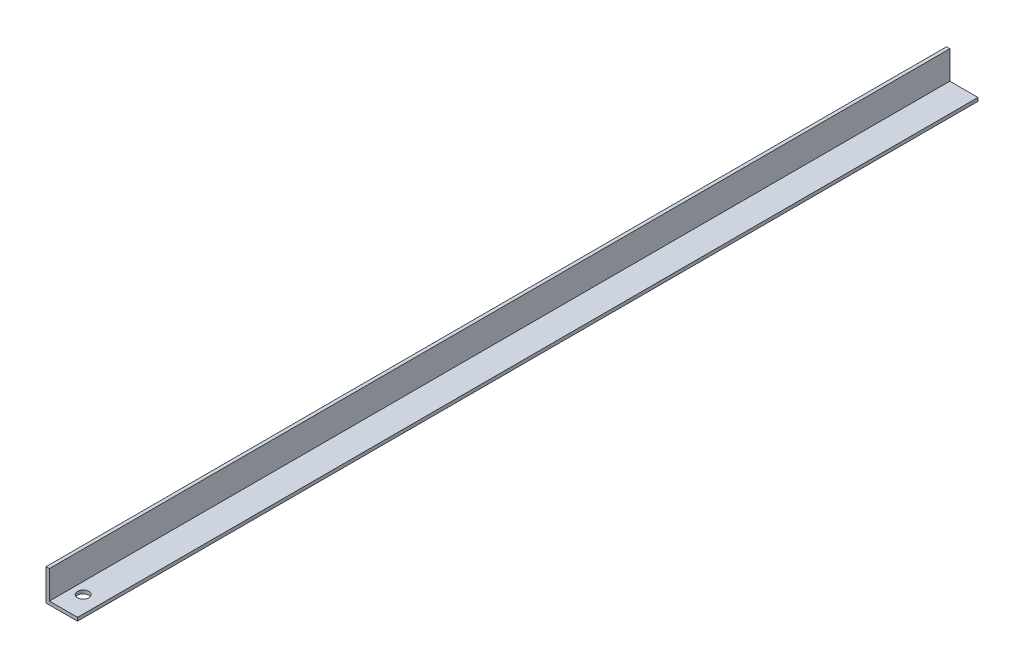
ISO-10303-21;
HEADER;
FILE_DESCRIPTION(('STEP AP214'),'2;1');
FILE_NAME('part.step','',(''),(''),'','','');
FILE_SCHEMA(('AUTOMOTIVE_DESIGN { 1 0 10303 214 1 1 1 1 }'));
ENDSEC;
DATA;
#1=APPLICATION_CONTEXT('core data for automotive mechanical design processes');
#2=APPLICATION_PROTOCOL_DEFINITION('international standard','automotive_design',2000,#1);
#3=PRODUCT_CONTEXT('',#1,'mechanical');
#4=PRODUCT('Part','Part','',(#3));
#5=PRODUCT_RELATED_PRODUCT_CATEGORY('part','',(#4));
#6=PRODUCT_DEFINITION_FORMATION('','',#4);
#7=PRODUCT_DEFINITION_CONTEXT('part definition',#1,'design');
#8=PRODUCT_DEFINITION('design','',#6,#7);
#9=PRODUCT_DEFINITION_SHAPE('','',#8);
#10=(LENGTH_UNIT() NAMED_UNIT(*) SI_UNIT(.MILLI.,.METRE.));
#11=(NAMED_UNIT(*) PLANE_ANGLE_UNIT() SI_UNIT($,.RADIAN.));
#12=(NAMED_UNIT(*) SI_UNIT($,.STERADIAN.) SOLID_ANGLE_UNIT());
#13=UNCERTAINTY_MEASURE_WITH_UNIT(LENGTH_MEASURE(1.E-05),#10,'distance_accuracy_value','');
#14=(GEOMETRIC_REPRESENTATION_CONTEXT(3) GLOBAL_UNCERTAINTY_ASSIGNED_CONTEXT((#13)) GLOBAL_UNIT_ASSIGNED_CONTEXT((#10,
#11,#12)) REPRESENTATION_CONTEXT('',''));
#15=CARTESIAN_POINT('',(0.,0.,0.));
#16=DIRECTION('',(0.,0.,1.));
#17=DIRECTION('',(1.,0.,0.));
#18=AXIS2_PLACEMENT_3D('',#15,#16,#17);
#19=CARTESIAN_POINT('',(0.,-3.,800.));
#20=DIRECTION('',(0.,1.,0.));
#21=DIRECTION('',(0.,0.,1.));
#22=AXIS2_PLACEMENT_3D('',#19,#20,#21);
#23=PLANE('',#22);
#24=CARTESIAN_POINT('',(10.,-3.,780.));
#25=DIRECTION('',(0.,-1.,0.));
#26=DIRECTION('',(0.,0.,-1.));
#27=AXIS2_PLACEMENT_3D('',#24,#25,#26);
#28=CIRCLE('',#27,5.);
#29=CARTESIAN_POINT('',(10.,-3.,775.));
#30=VERTEX_POINT('',#29);
#31=EDGE_CURVE('E159',#30,#30,#28,.T.);
#32=ORIENTED_EDGE('',*,*,#31,.F.);
#33=EDGE_LOOP('',(#32));
#34=FACE_BOUND('',#33,.T.);
#35=DIRECTION('',(1.,0.,0.));
#36=VECTOR('',#35,1.);
#37=CARTESIAN_POINT('',(0.,-3.,0.));
#38=LINE('',#37,#36);
#39=CARTESIAN_POINT('',(-3.,-3.,0.));
#40=VERTEX_POINT('',#39);
#41=CARTESIAN_POINT('',(25.,-3.,0.));
#42=VERTEX_POINT('',#41);
#43=EDGE_CURVE('E115',#40,#42,#38,.T.);
#44=ORIENTED_EDGE('',*,*,#43,.T.);
#45=DIRECTION('',(0.,0.,-1.));
#46=VECTOR('',#45,1.);
#47=CARTESIAN_POINT('',(25.,-3.,800.));
#48=LINE('',#47,#46);
#49=CARTESIAN_POINT('',(25.,-3.,800.));
#50=VERTEX_POINT('',#49);
#51=EDGE_CURVE('E11',#50,#42,#48,.T.);
#52=ORIENTED_EDGE('',*,*,#51,.F.);
#53=DIRECTION('',(1.,0.,0.));
#54=VECTOR('',#53,1.);
#55=CARTESIAN_POINT('',(0.,-3.,800.));
#56=LINE('',#55,#54);
#57=CARTESIAN_POINT('',(-3.,-3.,800.));
#58=VERTEX_POINT('',#57);
#59=EDGE_CURVE('E80',#58,#50,#56,.T.);
#60=ORIENTED_EDGE('',*,*,#59,.F.);
#61=DIRECTION('',(0.,0.,-1.));
#62=VECTOR('',#61,1.);
#63=CARTESIAN_POINT('',(-3.,-3.,800.));
#64=LINE('',#63,#62);
#65=EDGE_CURVE('E111',#58,#40,#64,.T.);
#66=ORIENTED_EDGE('',*,*,#65,.T.);
#67=EDGE_LOOP('',(#44,#52,#60,#66));
#68=FACE_BOUND('',#67,.T.);
#69=ADVANCED_FACE('F33',(#34,#68),#23,.F.);
#70=CARTESIAN_POINT('',(25.,0.,800.));
#71=DIRECTION('',(1.,0.,0.));
#72=DIRECTION('',(0.,0.,-1.));
#73=AXIS2_PLACEMENT_3D('',#70,#71,#72);
#74=PLANE('',#73);
#75=DIRECTION('',(0.,-1.,0.));
#76=VECTOR('',#75,1.);
#77=CARTESIAN_POINT('',(25.,0.,0.));
#78=LINE('',#77,#76);
#79=CARTESIAN_POINT('',(25.,0.,0.));
#80=VERTEX_POINT('',#79);
#81=EDGE_CURVE('E118',#80,#42,#78,.T.);
#82=ORIENTED_EDGE('',*,*,#81,.F.);
#83=DIRECTION('',(0.,0.,-1.));
#84=VECTOR('',#83,1.);
#85=CARTESIAN_POINT('',(25.,0.,800.));
#86=LINE('',#85,#84);
#87=CARTESIAN_POINT('',(25.,0.,800.));
#88=VERTEX_POINT('',#87);
#89=EDGE_CURVE('E42',#88,#80,#86,.T.);
#90=ORIENTED_EDGE('',*,*,#89,.F.);
#91=DIRECTION('',(0.,-1.,0.));
#92=VECTOR('',#91,1.);
#93=CARTESIAN_POINT('',(25.,0.,800.));
#94=LINE('',#93,#92);
#95=EDGE_CURVE('E165',#88,#50,#94,.T.);
#96=ORIENTED_EDGE('',*,*,#95,.T.);
#97=ORIENTED_EDGE('',*,*,#51,.T.);
#98=EDGE_LOOP('',(#82,#90,#96,#97));
#99=FACE_BOUND('',#98,.T.);
#100=ADVANCED_FACE('F137',(#99),#74,.T.);
#101=CARTESIAN_POINT('',(0.,0.,800.));
#102=DIRECTION('',(0.,1.,0.));
#103=DIRECTION('',(0.,0.,1.));
#104=AXIS2_PLACEMENT_3D('',#101,#102,#103);
#105=PLANE('',#104);
#106=CARTESIAN_POINT('',(10.,0.,780.));
#107=DIRECTION('',(0.,1.,0.));
#108=DIRECTION('',(0.,0.,1.));
#109=AXIS2_PLACEMENT_3D('',#106,#107,#108);
#110=CIRCLE('',#109,5.);
#111=CARTESIAN_POINT('',(10.,0.,785.));
#112=VERTEX_POINT('',#111);
#113=EDGE_CURVE('E36',#112,#112,#110,.T.);
#114=ORIENTED_EDGE('',*,*,#113,.F.);
#115=EDGE_LOOP('',(#114));
#116=FACE_BOUND('',#115,.T.);
#117=DIRECTION('',(1.,0.,0.));
#118=VECTOR('',#117,1.);
#119=CARTESIAN_POINT('',(0.,0.,0.));
#120=LINE('',#119,#118);
#121=CARTESIAN_POINT('',(0.,0.,0.));
#122=VERTEX_POINT('',#121);
#123=EDGE_CURVE('E121',#122,#80,#120,.T.);
#124=ORIENTED_EDGE('',*,*,#123,.F.);
#125=DIRECTION('',(0.,0.,-1.));
#126=VECTOR('',#125,1.);
#127=CARTESIAN_POINT('',(0.,0.,800.));
#128=LINE('',#127,#126);
#129=CARTESIAN_POINT('',(0.,0.,800.));
#130=VERTEX_POINT('',#129);
#131=EDGE_CURVE('E101',#130,#122,#128,.T.);
#132=ORIENTED_EDGE('',*,*,#131,.F.);
#133=DIRECTION('',(1.,0.,0.));
#134=VECTOR('',#133,1.);
#135=CARTESIAN_POINT('',(0.,0.,800.));
#136=LINE('',#135,#134);
#137=EDGE_CURVE('E107',#130,#88,#136,.T.);
#138=ORIENTED_EDGE('',*,*,#137,.T.);
#139=ORIENTED_EDGE('',*,*,#89,.T.);
#140=EDGE_LOOP('',(#124,#132,#138,#139));
#141=FACE_BOUND('',#140,.T.);
#142=ADVANCED_FACE('F134',(#116,#141),#105,.T.);
#143=CARTESIAN_POINT('',(0.,25.,800.));
#144=DIRECTION('',(1.,0.,0.));
#145=DIRECTION('',(0.,1.,0.));
#146=AXIS2_PLACEMENT_3D('',#143,#144,#145);
#147=PLANE('',#146);
#148=DIRECTION('',(0.,-1.,0.));
#149=VECTOR('',#148,1.);
#150=CARTESIAN_POINT('',(0.,25.,0.));
#151=LINE('',#150,#149);
#152=CARTESIAN_POINT('',(0.,25.,0.));
#153=VERTEX_POINT('',#152);
#154=EDGE_CURVE('E96',#153,#122,#151,.T.);
#155=ORIENTED_EDGE('',*,*,#154,.F.);
#156=DIRECTION('',(0.,0.,-1.));
#157=VECTOR('',#156,1.);
#158=CARTESIAN_POINT('',(0.,25.,800.));
#159=LINE('',#158,#157);
#160=CARTESIAN_POINT('',(0.,25.,800.));
#161=VERTEX_POINT('',#160);
#162=EDGE_CURVE('E91',#161,#153,#159,.T.);
#163=ORIENTED_EDGE('',*,*,#162,.F.);
#164=DIRECTION('',(0.,-1.,0.));
#165=VECTOR('',#164,1.);
#166=CARTESIAN_POINT('',(0.,25.,800.));
#167=LINE('',#166,#165);
#168=EDGE_CURVE('E94',#161,#130,#167,.T.);
#169=ORIENTED_EDGE('',*,*,#168,.T.);
#170=ORIENTED_EDGE('',*,*,#131,.T.);
#171=EDGE_LOOP('',(#155,#163,#169,#170));
#172=FACE_BOUND('',#171,.T.);
#173=ADVANCED_FACE('F93',(#172),#147,.T.);
#174=CARTESIAN_POINT('',(-3.,25.,800.));
#175=DIRECTION('',(0.,1.,0.));
#176=DIRECTION('',(0.,0.,1.));
#177=AXIS2_PLACEMENT_3D('',#174,#175,#176);
#178=PLANE('',#177);
#179=DIRECTION('',(1.,0.,0.));
#180=VECTOR('',#179,1.);
#181=CARTESIAN_POINT('',(-3.,25.,0.));
#182=LINE('',#181,#180);
#183=CARTESIAN_POINT('',(-3.,25.,0.));
#184=VERTEX_POINT('',#183);
#185=EDGE_CURVE('E125',#184,#153,#182,.T.);
#186=ORIENTED_EDGE('',*,*,#185,.F.);
#187=DIRECTION('',(0.,0.,-1.));
#188=VECTOR('',#187,1.);
#189=CARTESIAN_POINT('',(-3.,25.,800.));
#190=LINE('',#189,#188);
#191=CARTESIAN_POINT('',(-3.,25.,800.));
#192=VERTEX_POINT('',#191);
#193=EDGE_CURVE('E71',#192,#184,#190,.T.);
#194=ORIENTED_EDGE('',*,*,#193,.F.);
#195=DIRECTION('',(1.,0.,0.));
#196=VECTOR('',#195,1.);
#197=CARTESIAN_POINT('',(-3.,25.,800.));
#198=LINE('',#197,#196);
#199=EDGE_CURVE('E105',#192,#161,#198,.T.);
#200=ORIENTED_EDGE('',*,*,#199,.T.);
#201=ORIENTED_EDGE('',*,*,#162,.T.);
#202=EDGE_LOOP('',(#186,#194,#200,#201));
#203=FACE_BOUND('',#202,.T.);
#204=ADVANCED_FACE('F109',(#203),#178,.T.);
#205=CARTESIAN_POINT('',(-3.,25.,800.));
#206=DIRECTION('',(1.,0.,0.));
#207=DIRECTION('',(0.,1.,0.));
#208=AXIS2_PLACEMENT_3D('',#205,#206,#207);
#209=PLANE('',#208);
#210=DIRECTION('',(0.,-1.,0.));
#211=VECTOR('',#210,1.);
#212=CARTESIAN_POINT('',(-3.,25.,0.));
#213=LINE('',#212,#211);
#214=EDGE_CURVE('E74',#184,#40,#213,.T.);
#215=ORIENTED_EDGE('',*,*,#214,.T.);
#216=ORIENTED_EDGE('',*,*,#65,.F.);
#217=DIRECTION('',(0.,-1.,0.));
#218=VECTOR('',#217,1.);
#219=CARTESIAN_POINT('',(-3.,25.,800.));
#220=LINE('',#219,#218);
#221=EDGE_CURVE('E50',#192,#58,#220,.T.);
#222=ORIENTED_EDGE('',*,*,#221,.F.);
#223=ORIENTED_EDGE('',*,*,#193,.T.);
#224=EDGE_LOOP('',(#215,#216,#222,#223));
#225=FACE_BOUND('',#224,.T.);
#226=ADVANCED_FACE('F142',(#225),#209,.F.);
#227=CARTESIAN_POINT('',(0.,0.,800.));
#228=DIRECTION('',(0.,0.,-1.));
#229=DIRECTION('',(-1.,0.,0.));
#230=AXIS2_PLACEMENT_3D('',#227,#228,#229);
#231=PLANE('',#230);
#232=ORIENTED_EDGE('',*,*,#59,.T.);
#233=ORIENTED_EDGE('',*,*,#95,.F.);
#234=ORIENTED_EDGE('',*,*,#137,.F.);
#235=ORIENTED_EDGE('',*,*,#168,.F.);
#236=ORIENTED_EDGE('',*,*,#199,.F.);
#237=ORIENTED_EDGE('',*,*,#221,.T.);
#238=EDGE_LOOP('',(#232,#233,#234,#235,#236,#237));
#239=FACE_BOUND('',#238,.T.);
#240=ADVANCED_FACE('F104',(#239),#231,.F.);
#241=CARTESIAN_POINT('',(0.,0.,0.));
#242=DIRECTION('',(0.,0.,-1.));
#243=DIRECTION('',(-1.,0.,0.));
#244=AXIS2_PLACEMENT_3D('',#241,#242,#243);
#245=PLANE('',#244);
#246=ORIENTED_EDGE('',*,*,#43,.F.);
#247=ORIENTED_EDGE('',*,*,#214,.F.);
#248=ORIENTED_EDGE('',*,*,#185,.T.);
#249=ORIENTED_EDGE('',*,*,#154,.T.);
#250=ORIENTED_EDGE('',*,*,#123,.T.);
#251=ORIENTED_EDGE('',*,*,#81,.T.);
#252=EDGE_LOOP('',(#246,#247,#248,#249,#250,#251));
#253=FACE_BOUND('',#252,.T.);
#254=ADVANCED_FACE('F140',(#253),#245,.T.);
#255=CARTESIAN_POINT('',(10.,7.,780.));
#256=DIRECTION('',(0.,-1.,0.));
#257=DIRECTION('',(0.,0.,-1.));
#258=AXIS2_PLACEMENT_3D('',#255,#256,#257);
#259=CYLINDRICAL_SURFACE('',#258,5.);
#260=ORIENTED_EDGE('',*,*,#113,.T.);
#261=EDGE_LOOP('',(#260));
#262=FACE_BOUND('',#261,.T.);
#263=ORIENTED_EDGE('',*,*,#31,.T.);
#264=EDGE_LOOP('',(#263));
#265=FACE_BOUND('',#264,.T.);
#266=ADVANCED_FACE('F168',(#262,#265),#259,.F.);
#267=CLOSED_SHELL('',(#69,#100,#142,#173,#204,#226,#240,#254,#266));
#268=MANIFOLD_SOLID_BREP('B2',#267);
#269=ADVANCED_BREP_SHAPE_REPRESENTATION('',(#18,#268),#14);
#270=SHAPE_DEFINITION_REPRESENTATION(#9,#269);
ENDSEC;
END-ISO-10303-21;
